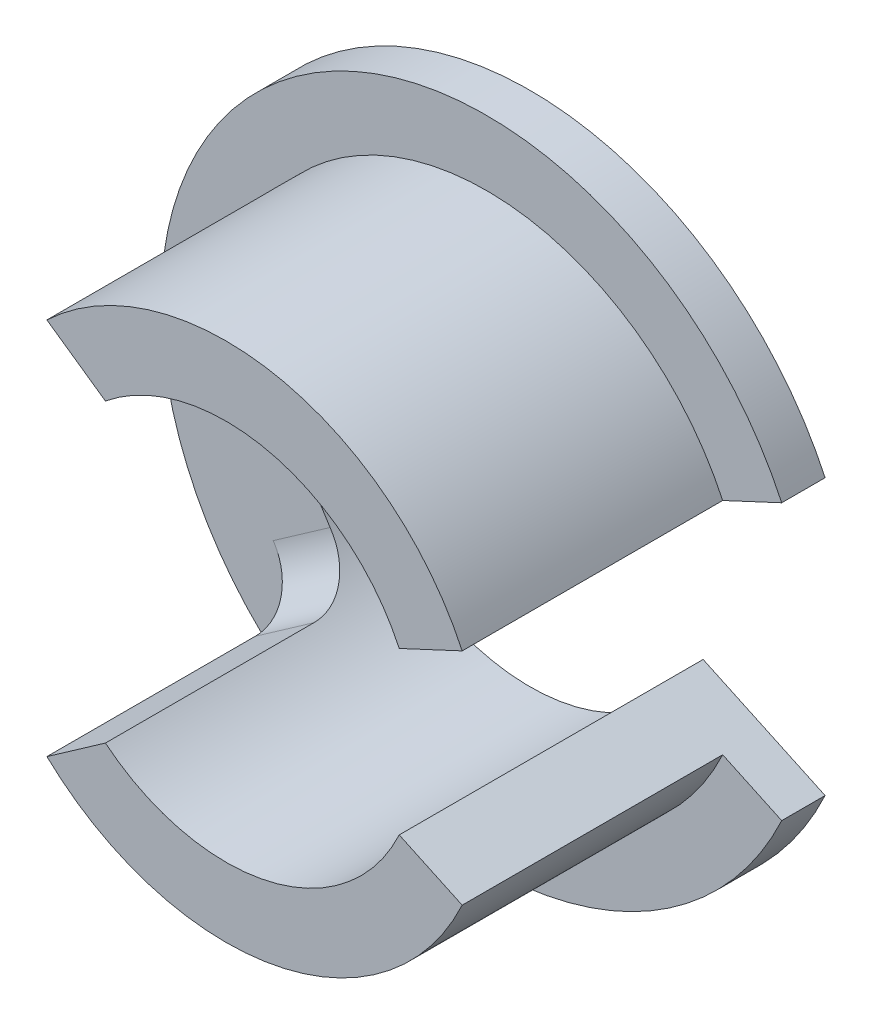
ISO-10303-21;
HEADER;
FILE_DESCRIPTION(('STEP AP214'),'2;1');
FILE_NAME('part.step','',(''),(''),'','','');
FILE_SCHEMA(('AUTOMOTIVE_DESIGN { 1 0 10303 214 1 1 1 1 }'));
ENDSEC;
DATA;
#1=APPLICATION_CONTEXT('core data for automotive mechanical design processes');
#2=APPLICATION_PROTOCOL_DEFINITION('international standard','automotive_design',2000,#1);
#3=PRODUCT_CONTEXT('',#1,'mechanical');
#4=PRODUCT('Part','Part','',(#3));
#5=PRODUCT_RELATED_PRODUCT_CATEGORY('part','',(#4));
#6=PRODUCT_DEFINITION_FORMATION('','',#4);
#7=PRODUCT_DEFINITION_CONTEXT('part definition',#1,'design');
#8=PRODUCT_DEFINITION('design','',#6,#7);
#9=PRODUCT_DEFINITION_SHAPE('','',#8);
#10=(LENGTH_UNIT() NAMED_UNIT(*) SI_UNIT(.MILLI.,.METRE.));
#11=(NAMED_UNIT(*) PLANE_ANGLE_UNIT() SI_UNIT($,.RADIAN.));
#12=(NAMED_UNIT(*) SI_UNIT($,.STERADIAN.) SOLID_ANGLE_UNIT());
#13=UNCERTAINTY_MEASURE_WITH_UNIT(LENGTH_MEASURE(1.E-05),#10,'distance_accuracy_value','');
#14=(GEOMETRIC_REPRESENTATION_CONTEXT(3) GLOBAL_UNCERTAINTY_ASSIGNED_CONTEXT((#13)) GLOBAL_UNIT_ASSIGNED_CONTEXT((#10,
#11,#12)) REPRESENTATION_CONTEXT('',''));
#15=CARTESIAN_POINT('',(0.,0.,0.));
#16=DIRECTION('',(0.,0.,1.));
#17=DIRECTION('',(1.,0.,0.));
#18=AXIS2_PLACEMENT_3D('',#15,#16,#17);
#19=CARTESIAN_POINT('',(0.,0.,6.));
#20=DIRECTION('',(0.,0.,-1.));
#21=DIRECTION('',(-1.,0.,0.));
#22=AXIS2_PLACEMENT_3D('',#19,#20,#21);
#23=CYLINDRICAL_SURFACE('',#22,6.);
#24=DIRECTION('',(0.,0.,-1.));
#25=VECTOR('',#24,1.);
#26=CARTESIAN_POINT('',(-4.12731914901656,4.35490948725243,6.));
#27=LINE('',#26,#25);
#28=CARTESIAN_POINT('',(-4.12731914901656,4.35490948725243,6.));
#29=VERTEX_POINT('',#28);
#30=CARTESIAN_POINT('',(-4.12731914901656,4.35490948725243,1.2));
#31=VERTEX_POINT('',#30);
#32=EDGE_CURVE('E224',#29,#31,#27,.T.);
#33=ORIENTED_EDGE('',*,*,#32,.F.);
#34=CARTESIAN_POINT('',(0.,0.,6.));
#35=DIRECTION('',(0.,0.,1.));
#36=DIRECTION('',(1.,0.,0.));
#37=AXIS2_PLACEMENT_3D('',#34,#35,#36);
#38=CIRCLE('',#37,6.);
#39=CARTESIAN_POINT('',(5.4378467222199,2.53570957044419,6.));
#40=VERTEX_POINT('',#39);
#41=EDGE_CURVE('E147',#40,#29,#38,.T.);
#42=ORIENTED_EDGE('',*,*,#41,.F.);
#43=DIRECTION('',(0.,0.,-1.));
#44=VECTOR('',#43,1.);
#45=CARTESIAN_POINT('',(5.4378467222199,2.53570957044419,6.));
#46=LINE('',#45,#44);
#47=CARTESIAN_POINT('',(5.43784672221998,2.5357095704442,0.));
#48=VERTEX_POINT('',#47);
#49=EDGE_CURVE('E164',#40,#48,#46,.T.);
#50=ORIENTED_EDGE('',*,*,#49,.T.);
#51=CARTESIAN_POINT('',(0.,0.,0.));
#52=DIRECTION('',(0.,0.,1.));
#53=DIRECTION('',(1.,0.,0.));
#54=AXIS2_PLACEMENT_3D('',#51,#52,#53);
#55=CIRCLE('',#54,6.);
#56=CARTESIAN_POINT('',(-4.91491226573395,3.44145861810628,0.));
#57=VERTEX_POINT('',#56);
#58=EDGE_CURVE('E165',#48,#57,#55,.T.);
#59=ORIENTED_EDGE('',*,*,#58,.T.);
#60=CARTESIAN_POINT('',(-4.91491226573395,3.44145861810628,0.));
#61=CARTESIAN_POINT('',(-4.89575145032599,3.46882579019035,-1.59771084100919E-07));
#62=CARTESIAN_POINT('',(-4.87636861824559,3.49601758269153,0.00139600961325712));
#63=CARTESIAN_POINT('',(-4.8372943326794,3.54988562956387,0.00696337264434707));
#64=CARTESIAN_POINT('',(-4.81760291606425,3.57656194468807,0.0111342371933441));
#65=CARTESIAN_POINT('',(-4.75835835430503,3.65545188131099,0.0277558787015131));
#66=CARTESIAN_POINT('',(-4.71854021499501,3.70666143818073,0.0443159057384283));
#67=CARTESIAN_POINT('',(-4.63962162793903,3.80498331681775,0.0878881215790612));
#68=CARTESIAN_POINT('',(-4.60052128919286,3.8520950203103,0.114901884279739));
#69=CARTESIAN_POINT('',(-4.52440989272803,3.94121178417932,0.178592168364046));
#70=CARTESIAN_POINT('',(-4.48739907621218,3.98321625564837,0.215269802533157));
#71=CARTESIAN_POINT('',(-4.41644252202698,4.06175766108089,0.297763543235219));
#72=CARTESIAN_POINT('',(-4.38253882352299,4.09822305281015,0.343683880799866));
#73=CARTESIAN_POINT('',(-4.31967543669473,4.16443190637796,0.443144716802443));
#74=CARTESIAN_POINT('',(-4.29071674648373,4.19417401156234,0.496686749633547));
#75=CARTESIAN_POINT('',(-4.23877070885305,4.24666978285592,0.610475385188785));
#76=CARTESIAN_POINT('',(-4.215841701988,4.26935553373821,0.670779974596941));
#77=CARTESIAN_POINT('',(-4.17742223680119,4.30695605382336,0.795985141129957));
#78=CARTESIAN_POINT('',(-4.16192645327083,4.32187638687429,0.860882389680751));
#79=CARTESIAN_POINT('',(-4.14285537171516,4.34014556287067,0.971789197498264));
#80=CARTESIAN_POINT('',(-4.13704228704735,4.3456795559701,1.01707779734613));
#81=CARTESIAN_POINT('',(-4.12926990479884,4.3530607429089,1.10823688766553));
#82=CARTESIAN_POINT('',(-4.12730689641615,4.35491148678339,1.15410677490711));
#83=CARTESIAN_POINT('',(-4.12731914901656,4.35490948725243,1.2));
#84=B_SPLINE_CURVE_WITH_KNOTS('',3,(#60,#61,#62,#63,#64,#65,#66,#67,#68,#69,#70,#71,#72,#73,#74,
#75,#76,#77,#78,#79,#80,#81,#82,#83),.UNSPECIFIED.,.F.,.F.,(4,2,2,2,2,2,2,2,2,2,2,4),(0.,
0.100161626240136,0.200311374746478,0.400122720254603,0.599964160736359,0.799828622831667,
1.0020878512882,1.20438785613811,1.40857864720857,1.61262293541136,1.75031180360672,
1.88786789840738),.UNSPECIFIED.);
#85=EDGE_CURVE('E11',#57,#31,#84,.T.);
#86=ORIENTED_EDGE('',*,*,#85,.T.);
#87=EDGE_LOOP('',(#33,#42,#50,#59,#86));
#88=FACE_BOUND('',#87,.T.);
#89=ADVANCED_FACE('F38',(#88),#23,.T.);
#90=CARTESIAN_POINT('',(0.,0.,6.));
#91=DIRECTION('',(0.,0.,-1.));
#92=DIRECTION('',(-1.,0.,0.));
#93=AXIS2_PLACEMENT_3D('',#90,#91,#92);
#94=CYLINDRICAL_SURFACE('',#93,4.4);
#95=CARTESIAN_POINT('',(0.,0.,0.));
#96=DIRECTION('',(0.,0.,1.));
#97=DIRECTION('',(1.,0.,0.));
#98=AXIS2_PLACEMENT_3D('',#95,#96,#97);
#99=CIRCLE('',#98,4.4);
#100=CARTESIAN_POINT('',(-3.60426899487156,-2.5237363199446,0.));
#101=VERTEX_POINT('',#100);
#102=CARTESIAN_POINT('',(-3.60426899487156,2.5237363199446,0.));
#103=VERTEX_POINT('',#102);
#104=EDGE_CURVE('E139',#101,#103,#99,.F.);
#105=ORIENTED_EDGE('',*,*,#104,.F.);
#106=CARTESIAN_POINT('',(-3.60426899487156,-2.5237363199446,0.));
#107=CARTESIAN_POINT('',(-3.58527884624053,-2.55086062919351,-4.62801717656896E-07));
#108=CARTESIAN_POINT('',(-3.56598823500658,-2.57775449382196,0.00137132246412853));
#109=CARTESIAN_POINT('',(-3.52694745624148,-2.63091743679048,0.00683941098958864));
#110=CARTESIAN_POINT('',(-3.50719736946582,-2.65718662330447,0.0109352389222312));
#111=CARTESIAN_POINT('',(-3.44758148720015,-2.73466729610688,0.0272462440025315));
#112=CARTESIAN_POINT('',(-3.40723229467924,-2.78471963145165,0.0434852314055237));
#113=CARTESIAN_POINT('',(-3.32675268378677,-2.88038816162648,0.0861591922085476));
#114=CARTESIAN_POINT('',(-3.28662224262126,-2.92600482733043,0.112593081873575));
#115=CARTESIAN_POINT('',(-3.2080222884744,-3.01197399019379,0.174865098744965));
#116=CARTESIAN_POINT('',(-3.16955333307101,-3.05232472920484,0.210706354847219));
#117=CARTESIAN_POINT('',(-3.09498851976601,-3.12792743812203,0.29167772461729));
#118=CARTESIAN_POINT('',(-3.05896164434718,-3.16305082932636,0.336991324501284));
#119=CARTESIAN_POINT('',(-2.99175655947117,-3.22669167155606,0.435237163313998));
#120=CARTESIAN_POINT('',(-2.96057949720605,-3.2552075603979,0.488171199123529));
#121=CARTESIAN_POINT('',(-2.9040346035952,-3.30576051657377,0.601338516059685));
#122=CARTESIAN_POINT('',(-2.87878396415788,-3.32766899331708,0.661687987042843));
#123=CARTESIAN_POINT('',(-2.8362337823256,-3.36401032868801,0.787221432559324));
#124=CARTESIAN_POINT('',(-2.81892737729523,-3.37844964093498,0.852401177700123));
#125=CARTESIAN_POINT('',(-2.79727504252248,-3.39637840168272,0.964930002556443));
#126=CARTESIAN_POINT('',(-2.79057298851779,-3.40187605393769,1.01152728918365));
#127=CARTESIAN_POINT('',(-2.78159919755538,-3.40921028762732,1.105407459274));
#128=CARTESIAN_POINT('',(-2.77932535471685,-3.41104860930302,1.15269000607143));
#129=CARTESIAN_POINT('',(-2.77934442860088,-3.41104742670125,1.2));
#130=B_SPLINE_CURVE_WITH_KNOTS('',3,(#106,#107,#108,#109,#110,#111,#112,#113,#114,#115,#116,
#117,#118,#119,#120,#121,#122,#123,#124,#125,#126,#127,#128,#129),.UNSPECIFIED.,.F.,.F.,(4,2,2,
2,2,2,2,2,2,2,2,4),(0.,0.0992708532977197,0.198524389047899,0.39642464127046,0.594303862164045,
0.792248981392048,0.994458695968137,1.19671616945342,1.40268781625164,1.6084811978215,
1.7503374134892,1.89212615150302),.UNSPECIFIED.);
#131=CARTESIAN_POINT('',(-2.77934442860088,-3.41104742670125,1.2));
#132=VERTEX_POINT('',#131);
#133=EDGE_CURVE('E186',#101,#132,#130,.T.);
#134=ORIENTED_EDGE('',*,*,#133,.T.);
#135=DIRECTION('',(0.,0.,1.));
#136=VECTOR('',#135,1.);
#137=CARTESIAN_POINT('',(-2.77934442860088,-3.41104742670125,0.));
#138=LINE('',#137,#136);
#139=CARTESIAN_POINT('',(-2.77934442860088,-3.41104742670125,6.));
#140=VERTEX_POINT('',#139);
#141=EDGE_CURVE('E148',#132,#140,#138,.T.);
#142=ORIENTED_EDGE('',*,*,#141,.T.);
#143=CARTESIAN_POINT('',(0.,0.,6.));
#144=DIRECTION('',(0.,0.,-1.));
#145=DIRECTION('',(-1.,0.,0.));
#146=AXIS2_PLACEMENT_3D('',#143,#144,#145);
#147=CIRCLE('',#146,4.4);
#148=CARTESIAN_POINT('',(3.98775426296126,-1.85952035165907,6.));
#149=VERTEX_POINT('',#148);
#150=EDGE_CURVE('E155',#149,#140,#147,.T.);
#151=ORIENTED_EDGE('',*,*,#150,.F.);
#152=DIRECTION('',(0.,0.,-1.));
#153=VECTOR('',#152,1.);
#154=CARTESIAN_POINT('',(3.98775426296126,-1.85952035165907,6.));
#155=LINE('',#154,#153);
#156=CARTESIAN_POINT('',(3.98775426296126,-1.85952035165907,-1.));
#157=VERTEX_POINT('',#156);
#158=EDGE_CURVE('E172',#149,#157,#155,.T.);
#159=ORIENTED_EDGE('',*,*,#158,.T.);
#160=CARTESIAN_POINT('',(0.,0.,-1.));
#161=DIRECTION('',(0.,0.,-1.));
#162=DIRECTION('',(-1.00000000000002,0.,0.));
#163=AXIS2_PLACEMENT_3D('',#160,#161,#162);
#164=CIRCLE('',#163,4.4);
#165=CARTESIAN_POINT('',(3.98775426296126,1.85952035165907,-1.));
#166=VERTEX_POINT('',#165);
#167=EDGE_CURVE('E242',#166,#157,#164,.F.);
#168=ORIENTED_EDGE('',*,*,#167,.F.);
#169=DIRECTION('',(0.,0.,-1.));
#170=VECTOR('',#169,1.);
#171=CARTESIAN_POINT('',(3.98775426296126,1.85952035165907,6.));
#172=LINE('',#171,#170);
#173=CARTESIAN_POINT('',(3.98775426296126,1.85952035165907,6.));
#174=VERTEX_POINT('',#173);
#175=EDGE_CURVE('E153',#174,#166,#172,.T.);
#176=ORIENTED_EDGE('',*,*,#175,.F.);
#177=CARTESIAN_POINT('',(-2.77934442860088,3.41104742670125,6.));
#178=VERTEX_POINT('',#177);
#179=EDGE_CURVE('E144',#178,#174,#147,.T.);
#180=ORIENTED_EDGE('',*,*,#179,.F.);
#181=DIRECTION('',(0.,0.,1.));
#182=VECTOR('',#181,1.);
#183=CARTESIAN_POINT('',(-2.77934442860088,3.41104742670125,0.));
#184=LINE('',#183,#182);
#185=CARTESIAN_POINT('',(-2.77934442860088,3.41104742670125,1.2));
#186=VERTEX_POINT('',#185);
#187=EDGE_CURVE('E131',#186,#178,#184,.T.);
#188=ORIENTED_EDGE('',*,*,#187,.F.);
#189=CARTESIAN_POINT('',(-2.77934442860088,3.41104742670125,1.2));
#190=CARTESIAN_POINT('',(-2.77934208946983,3.41104642956212,1.16691195953624));
#191=CARTESIAN_POINT('',(-2.78044806810827,3.4101484776091,1.13384042834089));
#192=CARTESIAN_POINT('',(-2.78484395007548,3.40656075451807,1.06794689740856));
#193=CARTESIAN_POINT('',(-2.78813343293852,3.40387132835431,1.0351248508602));
#194=CARTESIAN_POINT('',(-2.80120111840937,3.3931411334644,0.93754467192182));
#195=CARTESIAN_POINT('',(-2.81417899722576,3.38243838194846,0.873460528770745));
#196=CARTESIAN_POINT('',(-2.84792548475399,3.35407205281836,0.749055080346113));
#197=CARTESIAN_POINT('',(-2.8686926425793,3.33640977150477,0.688733076748612));
#198=CARTESIAN_POINT('',(-2.91692919400609,3.29432020048991,0.573332670102656));
#199=CARTESIAN_POINT('',(-2.94440116899407,3.26989030473446,0.518256298028639));
#200=CARTESIAN_POINT('',(-3.00544928293862,3.21388022756531,0.413513253252818));
#201=CARTESIAN_POINT('',(-3.03915346586474,3.18214579574924,0.364003738299512));
#202=CARTESIAN_POINT('',(-3.11070271905138,3.11223812241796,0.273181489355957));
#203=CARTESIAN_POINT('',(-3.14854858002071,3.07406365064597,0.231870324804789));
#204=CARTESIAN_POINT('',(-3.22746681374527,2.99111800455882,0.157949414295825));
#205=CARTESIAN_POINT('',(-3.26858328679814,2.94624520715162,0.125500508132037));
#206=CARTESIAN_POINT('',(-3.35176078194022,2.85125808730684,0.0712867012543457));
#207=CARTESIAN_POINT('',(-3.3938210074928,2.80114806346304,0.0495131207399427));
#208=CARTESIAN_POINT('',(-3.46430369789177,2.71306548347898,0.022357910608848));
#209=CARTESIAN_POINT('',(-3.49291655628263,2.67613876857479,0.0139883088491058));
#210=CARTESIAN_POINT('',(-3.54931979753605,2.60087810735488,0.00280501864488715));
#211=CARTESIAN_POINT('',(-3.57711063165497,2.56254496001483,-1.17759816312244E-05));
#212=CARTESIAN_POINT('',(-3.60426899487156,2.5237363199446,0.));
#213=B_SPLINE_CURVE_WITH_KNOTS('',3,(#189,#190,#191,#192,#193,#194,#195,#196,#197,#198,#199,
#200,#201,#202,#203,#204,#205,#206,#207,#208,#209,#210,#211,#212),.UNSPECIFIED.,.F.,.F.,(4,2,2,
2,2,2,2,2,2,2,2,4),(0.,0.0992010519358632,0.198383006795373,0.39611934818689,0.593818876076943,
0.791594639631127,0.994008582931045,1.19646123774566,1.40237514714957,1.60812135507257,
1.75016366653038,1.89212649843722),.UNSPECIFIED.);
#214=EDGE_CURVE('E52',#186,#103,#213,.T.);
#215=ORIENTED_EDGE('',*,*,#214,.T.);
#216=EDGE_LOOP('',(#105,#134,#142,#151,#159,#168,#176,#180,#188,#215));
#217=FACE_BOUND('',#216,.T.);
#218=ADVANCED_FACE('F151',(#217),#94,.F.);
#219=CARTESIAN_POINT('',(0.,0.,6.));
#220=DIRECTION('',(0.,0.,1.));
#221=DIRECTION('',(1.,0.,0.));
#222=AXIS2_PLACEMENT_3D('',#219,#220,#221);
#223=PLANE('',#222);
#224=ORIENTED_EDGE('',*,*,#41,.T.);
#225=DIRECTION('',(0.819152044288991,-0.573576436351047,0.));
#226=VECTOR('',#225,1.);
#227=CARTESIAN_POINT('',(0.688291723621255,0.982982453146787,6.));
#228=LINE('',#227,#226);
#229=EDGE_CURVE('E134',#29,#178,#228,.T.);
#230=ORIENTED_EDGE('',*,*,#229,.T.);
#231=ORIENTED_EDGE('',*,*,#179,.T.);
#232=DIRECTION('',(0.90630778703665,0.422618261740698,0.));
#233=VECTOR('',#232,1.);
#234=CARTESIAN_POINT('',(3.98775426296126,1.85952035165907,6.));
#235=LINE('',#234,#233);
#236=EDGE_CURVE('E159',#174,#40,#235,.T.);
#237=ORIENTED_EDGE('',*,*,#236,.T.);
#238=EDGE_LOOP('',(#224,#230,#231,#237));
#239=FACE_BOUND('',#238,.T.);
#240=ADVANCED_FACE('F143',(#239),#223,.T.);
#241=CARTESIAN_POINT('',(-4.12731914901656,-4.35490948725243,6.));
#242=VERTEX_POINT('',#241);
#243=CARTESIAN_POINT('',(5.4378467222199,-2.53570957044419,6.));
#244=VERTEX_POINT('',#243);
#245=EDGE_CURVE('E167',#242,#244,#38,.T.);
#246=ORIENTED_EDGE('',*,*,#245,.F.);
#247=DIRECTION('',(0.,0.,-1.));
#248=VECTOR('',#247,1.);
#249=CARTESIAN_POINT('',(-4.12731914901656,-4.35490948725243,6.));
#250=LINE('',#249,#248);
#251=CARTESIAN_POINT('',(-4.12731914901656,-4.35490948725243,1.2));
#252=VERTEX_POINT('',#251);
#253=EDGE_CURVE('E138',#242,#252,#250,.T.);
#254=ORIENTED_EDGE('',*,*,#253,.T.);
#255=CARTESIAN_POINT('',(-4.12731914901656,-4.35490948725243,1.2));
#256=CARTESIAN_POINT('',(-4.12731764111026,-4.35490864875048,1.16659870671718));
#257=CARTESIAN_POINT('',(-4.12835302089736,-4.35392989163613,1.13321375465329));
#258=CARTESIAN_POINT('',(-4.13247270172045,-4.35002084254706,1.06668951971157));
#259=CARTESIAN_POINT('',(-4.13555674907937,-4.3470907921919,1.03355020693102));
#260=CARTESIAN_POINT('',(-4.1478247926914,-4.33539905618454,0.93497014502562));
#261=CARTESIAN_POINT('',(-4.16002495169473,-4.32373571647303,0.870200379803861));
#262=CARTESIAN_POINT('',(-4.19186769404756,-4.29286971909956,0.744429729103898));
#263=CARTESIAN_POINT('',(-4.21151122445343,-4.27366610204016,0.683429324368956));
#264=CARTESIAN_POINT('',(-4.25731859931129,-4.22803498745672,0.566803623035975));
#265=CARTESIAN_POINT('',(-4.28348329338331,-4.20160654859196,0.51117902814529));
#266=CARTESIAN_POINT('',(-4.34154818661261,-4.14158421508018,0.406129110511559));
#267=CARTESIAN_POINT('',(-4.37351614958942,-4.10790467910844,0.35679020646174));
#268=CARTESIAN_POINT('',(-4.44163074166912,-4.03415803782074,0.266456004446862));
#269=CARTESIAN_POINT('',(-4.47777815833734,-3.99408972808,0.22546228305713));
#270=CARTESIAN_POINT('',(-4.55315873217676,-3.90794666000911,0.152643414537147));
#271=CARTESIAN_POINT('',(-4.59241664484231,-3.86182128062142,0.120903746376848));
#272=CARTESIAN_POINT('',(-4.67222748252603,-3.76486667841725,0.0680561743011079));
#273=CARTESIAN_POINT('',(-4.71277947770441,-3.71404078535546,0.0469408115924751));
#274=CARTESIAN_POINT('',(-4.7805404916003,-3.62607752668126,0.0210222271502226));
#275=CARTESIAN_POINT('',(-4.80780443688198,-3.5898572526423,0.0131482208937325));
#276=CARTESIAN_POINT('',(-4.86182666989538,-3.5163537079026,0.00263537222736833));
#277=CARTESIAN_POINT('',(-4.88858543029357,-3.47907152202116,-8.63126073095633E-06));
#278=CARTESIAN_POINT('',(-4.91491226573395,-3.44145861810628,0.));
#279=B_SPLINE_CURVE_WITH_KNOTS('',3,(#255,#256,#257,#258,#259,#260,#261,#262,#263,#264,#265,
#266,#267,#268,#269,#270,#271,#272,#273,#274,#275,#276,#277,#278),.UNSPECIFIED.,.F.,.F.,(4,2,2,
2,2,2,2,2,2,2,2,4),(0.,0.100141242952308,0.200270088185874,0.400033576783349,0.599822490800818,
0.799637448249876,1.00195631609977,1.20431337071424,1.40848431084597,1.6125117120772,
1.75025786626582,1.88786802166453),.UNSPECIFIED.);
#280=CARTESIAN_POINT('',(-4.91491226573395,-3.44145861810628,0.));
#281=VERTEX_POINT('',#280);
#282=EDGE_CURVE('E193',#252,#281,#279,.T.);
#283=ORIENTED_EDGE('',*,*,#282,.T.);
#284=CARTESIAN_POINT('',(5.4378467222199,-2.53570957044419,0.));
#285=VERTEX_POINT('',#284);
#286=EDGE_CURVE('E168',#281,#285,#55,.T.);
#287=ORIENTED_EDGE('',*,*,#286,.T.);
#288=DIRECTION('',(0.,0.,-1.));
#289=VECTOR('',#288,1.);
#290=CARTESIAN_POINT('',(5.4378467222199,-2.53570957044419,6.));
#291=LINE('',#290,#289);
#292=EDGE_CURVE('E174',#244,#285,#291,.T.);
#293=ORIENTED_EDGE('',*,*,#292,.F.);
#294=EDGE_LOOP('',(#246,#254,#283,#287,#293));
#295=FACE_BOUND('',#294,.T.);
#296=ADVANCED_FACE('F205',(#295),#23,.T.);
#297=CARTESIAN_POINT('',(5.4378467222199,-2.53570957044419,6.));
#298=DIRECTION('',(-0.422618261740698,-0.90630778703665,0.));
#299=DIRECTION('',(0.906307787036651,-0.422618261740698,0.));
#300=AXIS2_PLACEMENT_3D('',#297,#298,#299);
#301=PLANE('',#300);
#302=ORIENTED_EDGE('',*,*,#292,.T.);
#303=DIRECTION('',(0.906307787036659,-0.4226182617407,0.));
#304=VECTOR('',#303,1.);
#305=CARTESIAN_POINT('',(0.,0.,0.));
#306=LINE('',#305,#304);
#307=CARTESIAN_POINT('',(6.79730840277488,-3.16963696305524,0.));
#308=VERTEX_POINT('',#307);
#309=EDGE_CURVE('E225',#285,#308,#306,.T.);
#310=ORIENTED_EDGE('',*,*,#309,.T.);
#311=DIRECTION('',(0.,0.,1.));
#312=VECTOR('',#311,1.);
#313=CARTESIAN_POINT('',(6.79730840277488,-3.16963696305524,-1.));
#314=LINE('',#313,#312);
#315=CARTESIAN_POINT('',(6.79730840277488,-3.16963696305524,-1.));
#316=VERTEX_POINT('',#315);
#317=EDGE_CURVE('E251',#316,#308,#314,.T.);
#318=ORIENTED_EDGE('',*,*,#317,.F.);
#319=DIRECTION('',(0.906307787036659,-0.4226182617407,0.));
#320=VECTOR('',#319,1.);
#321=CARTESIAN_POINT('',(0.,0.,-1.));
#322=LINE('',#321,#320);
#323=EDGE_CURVE('E233',#157,#316,#322,.T.);
#324=ORIENTED_EDGE('',*,*,#323,.F.);
#325=ORIENTED_EDGE('',*,*,#158,.F.);
#326=DIRECTION('',(-0.90630778703665,0.422618261740698,0.));
#327=VECTOR('',#326,1.);
#328=CARTESIAN_POINT('',(5.4378467222199,-2.53570957044419,6.));
#329=LINE('',#328,#327);
#330=EDGE_CURVE('E156',#244,#149,#329,.T.);
#331=ORIENTED_EDGE('',*,*,#330,.F.);
#332=EDGE_LOOP('',(#302,#310,#318,#324,#325,#331));
#333=FACE_BOUND('',#332,.T.);
#334=ADVANCED_FACE('F209',(#333),#301,.F.);
#335=CARTESIAN_POINT('',(3.98775426296126,1.85952035165907,6.));
#336=DIRECTION('',(-0.422618261740698,0.90630778703665,0.));
#337=DIRECTION('',(-0.906307787036651,-0.422618261740698,0.));
#338=AXIS2_PLACEMENT_3D('',#335,#336,#337);
#339=PLANE('',#338);
#340=ORIENTED_EDGE('',*,*,#175,.T.);
#341=DIRECTION('',(-0.906307787036663,-0.4226182617407,0.));
#342=VECTOR('',#341,1.);
#343=CARTESIAN_POINT('',(0.,0.,-1.));
#344=LINE('',#343,#342);
#345=CARTESIAN_POINT('',(6.79730840277493,3.16963696305524,-1.));
#346=VERTEX_POINT('',#345);
#347=EDGE_CURVE('E239',#346,#166,#344,.T.);
#348=ORIENTED_EDGE('',*,*,#347,.F.);
#349=DIRECTION('',(0.,0.,1.));
#350=VECTOR('',#349,1.);
#351=CARTESIAN_POINT('',(6.79730840277493,3.16963696305524,-1.));
#352=LINE('',#351,#350);
#353=CARTESIAN_POINT('',(6.79730840277493,3.16963696305524,0.));
#354=VERTEX_POINT('',#353);
#355=EDGE_CURVE('E244',#346,#354,#352,.T.);
#356=ORIENTED_EDGE('',*,*,#355,.T.);
#357=DIRECTION('',(-0.906307787036663,-0.4226182617407,0.));
#358=VECTOR('',#357,1.);
#359=CARTESIAN_POINT('',(0.,0.,0.));
#360=LINE('',#359,#358);
#361=EDGE_CURVE('E237',#354,#48,#360,.T.);
#362=ORIENTED_EDGE('',*,*,#361,.T.);
#363=ORIENTED_EDGE('',*,*,#49,.F.);
#364=ORIENTED_EDGE('',*,*,#236,.F.);
#365=EDGE_LOOP('',(#340,#348,#356,#362,#363,#364));
#366=FACE_BOUND('',#365,.T.);
#367=ADVANCED_FACE('F213',(#366),#339,.F.);
#368=DIRECTION('',(0.819152044288991,0.573576436351047,0.));
#369=VECTOR('',#368,1.);
#370=CARTESIAN_POINT('',(0.688291723621255,-0.982982453146788,6.));
#371=LINE('',#370,#369);
#372=EDGE_CURVE('E259',#242,#140,#371,.T.);
#373=ORIENTED_EDGE('',*,*,#372,.F.);
#374=ORIENTED_EDGE('',*,*,#245,.T.);
#375=ORIENTED_EDGE('',*,*,#330,.T.);
#376=ORIENTED_EDGE('',*,*,#150,.T.);
#377=EDGE_LOOP('',(#373,#374,#375,#376));
#378=FACE_BOUND('',#377,.T.);
#379=ADVANCED_FACE('F218',(#378),#223,.T.);
#380=CARTESIAN_POINT('',(0.,0.,-1.));
#381=DIRECTION('',(0.,0.,1.));
#382=DIRECTION('',(1.,0.,0.));
#383=AXIS2_PLACEMENT_3D('',#380,#381,#382);
#384=CYLINDRICAL_SURFACE('',#383,7.5);
#385=CARTESIAN_POINT('',(0.,0.,0.));
#386=DIRECTION('',(0.,0.,-1.));
#387=DIRECTION('',(-1.00000000000002,0.,0.));
#388=AXIS2_PLACEMENT_3D('',#385,#386,#387);
#389=CIRCLE('',#388,7.5);
#390=EDGE_CURVE('E227',#308,#354,#389,.T.);
#391=ORIENTED_EDGE('',*,*,#390,.T.);
#392=ORIENTED_EDGE('',*,*,#355,.F.);
#393=CARTESIAN_POINT('',(0.,0.,-1.));
#394=DIRECTION('',(0.,0.,-1.));
#395=DIRECTION('',(-1.00000000000002,0.,0.));
#396=AXIS2_PLACEMENT_3D('',#393,#394,#395);
#397=CIRCLE('',#396,7.5);
#398=EDGE_CURVE('E236',#316,#346,#397,.T.);
#399=ORIENTED_EDGE('',*,*,#398,.F.);
#400=ORIENTED_EDGE('',*,*,#317,.T.);
#401=EDGE_LOOP('',(#391,#392,#399,#400));
#402=FACE_BOUND('',#401,.T.);
#403=ADVANCED_FACE('F273',(#402),#384,.T.);
#404=CARTESIAN_POINT('',(0.,0.,-1.));
#405=DIRECTION('',(0.,0.,-1.));
#406=DIRECTION('',(-1.00000000000002,0.,0.));
#407=AXIS2_PLACEMENT_3D('',#404,#405,#406);
#408=PLANE('',#407);
#409=ORIENTED_EDGE('',*,*,#323,.T.);
#410=ORIENTED_EDGE('',*,*,#398,.T.);
#411=ORIENTED_EDGE('',*,*,#347,.T.);
#412=ORIENTED_EDGE('',*,*,#167,.T.);
#413=EDGE_LOOP('',(#409,#410,#411,#412));
#414=FACE_BOUND('',#413,.T.);
#415=ADVANCED_FACE('F277',(#414),#408,.T.);
#416=CARTESIAN_POINT('',(0.,0.,0.));
#417=DIRECTION('',(0.,0.,-1.));
#418=DIRECTION('',(-1.00000000000002,0.,0.));
#419=AXIS2_PLACEMENT_3D('',#416,#417,#418);
#420=PLANE('',#419);
#421=ORIENTED_EDGE('',*,*,#286,.F.);
#422=DIRECTION('',(0.819152044288991,0.573576436351047,0.));
#423=VECTOR('',#422,1.);
#424=CARTESIAN_POINT('',(-3.46763615222214,-2.42806497355446,0.));
#425=LINE('',#424,#423);
#426=EDGE_CURVE('E180',#281,#101,#425,.T.);
#427=ORIENTED_EDGE('',*,*,#426,.T.);
#428=ORIENTED_EDGE('',*,*,#104,.T.);
#429=DIRECTION('',(0.819152044288991,-0.573576436351047,0.));
#430=VECTOR('',#429,1.);
#431=CARTESIAN_POINT('',(0.,0.,0.));
#432=LINE('',#431,#430);
#433=EDGE_CURVE('E177',#103,#57,#432,.F.);
#434=ORIENTED_EDGE('',*,*,#433,.T.);
#435=ORIENTED_EDGE('',*,*,#58,.F.);
#436=ORIENTED_EDGE('',*,*,#361,.F.);
#437=ORIENTED_EDGE('',*,*,#390,.F.);
#438=ORIENTED_EDGE('',*,*,#309,.F.);
#439=EDGE_LOOP('',(#421,#427,#428,#434,#435,#436,#437,#438));
#440=FACE_BOUND('',#439,.T.);
#441=ADVANCED_FACE('F269',(#440),#420,.F.);
#442=CARTESIAN_POINT('',(0.688291723621255,-0.982982453146788,0.));
#443=DIRECTION('',(0.573576436351047,-0.819152044288991,0.));
#444=DIRECTION('',(0.819152044288991,0.573576436351047,0.));
#445=AXIS2_PLACEMENT_3D('',#442,#443,#444);
#446=PLANE('',#445);
#447=ORIENTED_EDGE('',*,*,#141,.F.);
#448=DIRECTION('',(0.819152044288991,0.573576436351047,0.));
#449=VECTOR('',#448,1.);
#450=CARTESIAN_POINT('',(-4.12731914901656,-4.35490948725243,1.2));
#451=LINE('',#450,#449);
#452=EDGE_CURVE('E183',#132,#252,#451,.F.);
#453=ORIENTED_EDGE('',*,*,#452,.T.);
#454=ORIENTED_EDGE('',*,*,#253,.F.);
#455=ORIENTED_EDGE('',*,*,#372,.T.);
#456=EDGE_LOOP('',(#447,#453,#454,#455));
#457=FACE_BOUND('',#456,.T.);
#458=ADVANCED_FACE('F281',(#457),#446,.F.);
#459=CARTESIAN_POINT('',(0.688291723621255,0.982982453146787,0.));
#460=DIRECTION('',(-0.573576436351047,-0.819152044288991,0.));
#461=DIRECTION('',(0.819152044288991,-0.573576436351047,0.));
#462=AXIS2_PLACEMENT_3D('',#459,#460,#461);
#463=PLANE('',#462);
#464=ORIENTED_EDGE('',*,*,#32,.T.);
#465=DIRECTION('',(0.819152044288991,-0.573576436351047,0.));
#466=VECTOR('',#465,1.);
#467=CARTESIAN_POINT('',(0.688291723621255,0.982982453146787,1.2));
#468=LINE('',#467,#466);
#469=EDGE_CURVE('E135',#31,#186,#468,.T.);
#470=ORIENTED_EDGE('',*,*,#469,.T.);
#471=ORIENTED_EDGE('',*,*,#187,.T.);
#472=ORIENTED_EDGE('',*,*,#229,.F.);
#473=EDGE_LOOP('',(#464,#470,#471,#472));
#474=FACE_BOUND('',#473,.T.);
#475=ADVANCED_FACE('F133',(#474),#463,.T.);
#476=CARTESIAN_POINT('',(0.,0.,1.2));
#477=DIRECTION('',(-0.819152044288991,-0.573576436351047,0.));
#478=DIRECTION('',(0.573576436351047,-0.819152044288991,0.));
#479=AXIS2_PLACEMENT_3D('',#476,#477,#478);
#480=CYLINDRICAL_SURFACE('',#479,1.2);
#481=ORIENTED_EDGE('',*,*,#282,.F.);
#482=ORIENTED_EDGE('',*,*,#452,.F.);
#483=ORIENTED_EDGE('',*,*,#133,.F.);
#484=ORIENTED_EDGE('',*,*,#426,.F.);
#485=EDGE_LOOP('',(#481,#482,#483,#484));
#486=FACE_BOUND('',#485,.T.);
#487=ADVANCED_FACE('F201',(#486),#480,.F.);
#488=CARTESIAN_POINT('',(0.,0.,1.2));
#489=DIRECTION('',(0.819152044288991,-0.573576436351047,0.));
#490=DIRECTION('',(0.573576436351047,0.819152044288991,0.));
#491=AXIS2_PLACEMENT_3D('',#488,#489,#490);
#492=CYLINDRICAL_SURFACE('',#491,1.2);
#493=ORIENTED_EDGE('',*,*,#85,.F.);
#494=ORIENTED_EDGE('',*,*,#433,.F.);
#495=ORIENTED_EDGE('',*,*,#214,.F.);
#496=ORIENTED_EDGE('',*,*,#469,.F.);
#497=EDGE_LOOP('',(#493,#494,#495,#496));
#498=FACE_BOUND('',#497,.T.);
#499=ADVANCED_FACE('F40',(#498),#492,.F.);
#500=CLOSED_SHELL('',(#89,#218,#240,#296,#334,#367,#379,#403,#415,#441,#458,#475,#487,#499));
#501=MANIFOLD_SOLID_BREP('B2',#500);
#502=ADVANCED_BREP_SHAPE_REPRESENTATION('',(#18,#501),#14);
#503=SHAPE_DEFINITION_REPRESENTATION(#9,#502);
ENDSEC;
END-ISO-10303-21;
